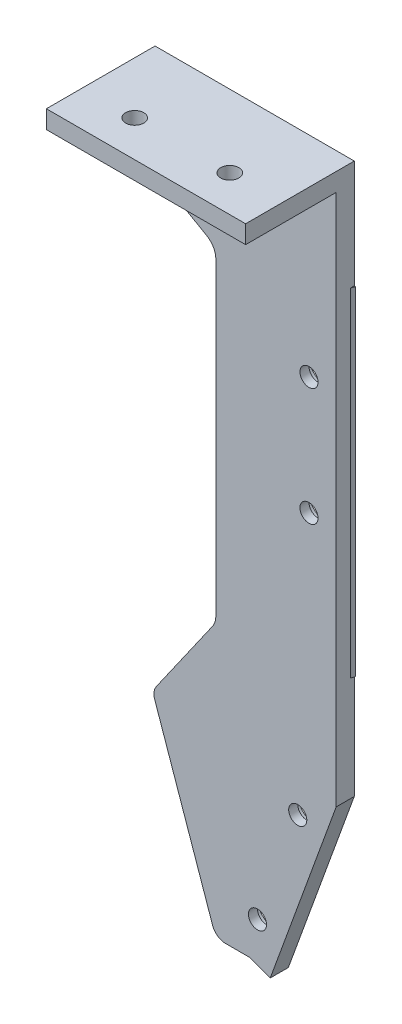
ISO-10303-21;
HEADER;
FILE_DESCRIPTION(('STEP AP214'),'2;1');
FILE_NAME('part.step','',(''),(''),'','','');
FILE_SCHEMA(('AUTOMOTIVE_DESIGN { 1 0 10303 214 1 1 1 1 }'));
ENDSEC;
DATA;
#1=APPLICATION_CONTEXT('core data for automotive mechanical design processes');
#2=APPLICATION_PROTOCOL_DEFINITION('international standard','automotive_design',2000,#1);
#3=PRODUCT_CONTEXT('',#1,'mechanical');
#4=PRODUCT('Part','Part','',(#3));
#5=PRODUCT_RELATED_PRODUCT_CATEGORY('part','',(#4));
#6=PRODUCT_DEFINITION_FORMATION('','',#4);
#7=PRODUCT_DEFINITION_CONTEXT('part definition',#1,'design');
#8=PRODUCT_DEFINITION('design','',#6,#7);
#9=PRODUCT_DEFINITION_SHAPE('','',#8);
#10=(LENGTH_UNIT() NAMED_UNIT(*) SI_UNIT(.MILLI.,.METRE.));
#11=(NAMED_UNIT(*) PLANE_ANGLE_UNIT() SI_UNIT($,.RADIAN.));
#12=(NAMED_UNIT(*) SI_UNIT($,.STERADIAN.) SOLID_ANGLE_UNIT());
#13=UNCERTAINTY_MEASURE_WITH_UNIT(LENGTH_MEASURE(1.E-05),#10,'distance_accuracy_value','');
#14=(GEOMETRIC_REPRESENTATION_CONTEXT(3) GLOBAL_UNCERTAINTY_ASSIGNED_CONTEXT((#13)) GLOBAL_UNIT_ASSIGNED_CONTEXT((#10,
#11,#12)) REPRESENTATION_CONTEXT('',''));
#15=CARTESIAN_POINT('',(0.,0.,0.));
#16=DIRECTION('',(0.,0.,1.));
#17=DIRECTION('',(1.,0.,0.));
#18=AXIS2_PLACEMENT_3D('',#15,#16,#17);
#19=CARTESIAN_POINT('',(92.2895532458189,-51.5135083268963,13.5));
#20=DIRECTION('',(0.,0.,1.));
#21=DIRECTION('',(1.,0.,0.));
#22=AXIS2_PLACEMENT_3D('',#19,#20,#21);
#23=CYLINDRICAL_SURFACE('',#22,0.999999999999998);
#24=CARTESIAN_POINT('',(92.2895532458189,-51.5135083268963,23.5));
#25=DIRECTION('',(0.,0.,1.));
#26=DIRECTION('',(1.,0.,0.));
#27=AXIS2_PLACEMENT_3D('',#24,#25,#26);
#28=CIRCLE('',#27,0.999999999999998);
#29=CARTESIAN_POINT('',(93.2895532458189,-51.5135083268963,23.5));
#30=VERTEX_POINT('',#29);
#31=EDGE_CURVE('E362',#30,#30,#28,.T.);
#32=ORIENTED_EDGE('',*,*,#31,.T.);
#33=EDGE_LOOP('',(#32));
#34=FACE_BOUND('',#33,.T.);
#35=CARTESIAN_POINT('',(92.2895532458189,-51.5135083268963,22.5));
#36=DIRECTION('',(0.,0.,-1.));
#37=DIRECTION('',(-1.,0.,0.));
#38=AXIS2_PLACEMENT_3D('',#35,#36,#37);
#39=CIRCLE('',#38,0.999999999999998);
#40=CARTESIAN_POINT('',(91.2895532458189,-51.5135083268963,22.5));
#41=VERTEX_POINT('',#40);
#42=EDGE_CURVE('E42',#41,#41,#39,.F.);
#43=ORIENTED_EDGE('',*,*,#42,.F.);
#44=EDGE_LOOP('',(#43));
#45=FACE_BOUND('',#44,.T.);
#46=ADVANCED_FACE('F38',(#34,#45),#23,.F.);
#47=CARTESIAN_POINT('',(91.0464555518717,-94.0197311334143,13.5));
#48=DIRECTION('',(0.,0.,1.));
#49=DIRECTION('',(1.,0.,0.));
#50=AXIS2_PLACEMENT_3D('',#47,#48,#49);
#51=CYLINDRICAL_SURFACE('',#50,0.999999999999998);
#52=CARTESIAN_POINT('',(91.0464555518717,-94.0197311334143,23.5));
#53=DIRECTION('',(0.,0.,1.));
#54=DIRECTION('',(1.,0.,0.));
#55=AXIS2_PLACEMENT_3D('',#52,#53,#54);
#56=CIRCLE('',#55,0.999999999999998);
#57=CARTESIAN_POINT('',(92.0464555518717,-94.0197311334143,23.5));
#58=VERTEX_POINT('',#57);
#59=EDGE_CURVE('E338',#58,#58,#56,.T.);
#60=ORIENTED_EDGE('',*,*,#59,.T.);
#61=EDGE_LOOP('',(#60));
#62=FACE_BOUND('',#61,.T.);
#63=CARTESIAN_POINT('',(91.0464555518717,-94.0197311334143,22.5));
#64=DIRECTION('',(0.,0.,-1.));
#65=DIRECTION('',(-1.,0.,0.));
#66=AXIS2_PLACEMENT_3D('',#63,#64,#65);
#67=CIRCLE('',#66,0.999999999999998);
#68=CARTESIAN_POINT('',(90.0464555518717,-94.0197311334143,22.5));
#69=VERTEX_POINT('',#68);
#70=EDGE_CURVE('E342',#69,#69,#67,.F.);
#71=ORIENTED_EDGE('',*,*,#70,.F.);
#72=EDGE_LOOP('',(#71));
#73=FACE_BOUND('',#72,.T.);
#74=ADVANCED_FACE('F462',(#62,#73),#51,.F.);
#75=CARTESIAN_POINT('',(92.2895532458189,-64.5135083268963,13.5));
#76=DIRECTION('',(0.,0.,1.));
#77=DIRECTION('',(1.,0.,0.));
#78=AXIS2_PLACEMENT_3D('',#75,#76,#77);
#79=CYLINDRICAL_SURFACE('',#78,0.999999999999998);
#80=CARTESIAN_POINT('',(92.2895532458189,-64.5135083268963,23.5));
#81=DIRECTION('',(0.,0.,1.));
#82=DIRECTION('',(1.,0.,0.));
#83=AXIS2_PLACEMENT_3D('',#80,#81,#82);
#84=CIRCLE('',#83,0.999999999999998);
#85=CARTESIAN_POINT('',(93.2895532458189,-64.5135083268963,23.5));
#86=VERTEX_POINT('',#85);
#87=EDGE_CURVE('E359',#86,#86,#84,.T.);
#88=ORIENTED_EDGE('',*,*,#87,.T.);
#89=EDGE_LOOP('',(#88));
#90=FACE_BOUND('',#89,.T.);
#91=CARTESIAN_POINT('',(92.2895532458189,-64.5135083268963,22.5));
#92=DIRECTION('',(0.,0.,-1.));
#93=DIRECTION('',(-1.,0.,0.));
#94=AXIS2_PLACEMENT_3D('',#91,#92,#93);
#95=CIRCLE('',#94,0.999999999999998);
#96=CARTESIAN_POINT('',(91.2895532458189,-64.5135083268963,22.5));
#97=VERTEX_POINT('',#96);
#98=EDGE_CURVE('E340',#97,#97,#95,.F.);
#99=ORIENTED_EDGE('',*,*,#98,.F.);
#100=EDGE_LOOP('',(#99));
#101=FACE_BOUND('',#100,.T.);
#102=ADVANCED_FACE('F468',(#90,#101),#79,.F.);
#103=CARTESIAN_POINT('',(86.6001936886376,-106.235735203631,13.5));
#104=DIRECTION('',(0.,0.,1.));
#105=DIRECTION('',(1.,0.,0.));
#106=AXIS2_PLACEMENT_3D('',#103,#104,#105);
#107=CYLINDRICAL_SURFACE('',#106,0.999999999999998);
#108=CARTESIAN_POINT('',(86.6001936886376,-106.235735203631,23.5));
#109=DIRECTION('',(0.,0.,1.));
#110=DIRECTION('',(1.,0.,0.));
#111=AXIS2_PLACEMENT_3D('',#108,#109,#110);
#112=CIRCLE('',#111,0.999999999999998);
#113=CARTESIAN_POINT('',(87.6001936886376,-106.235735203631,23.5));
#114=VERTEX_POINT('',#113);
#115=EDGE_CURVE('E363',#114,#114,#112,.T.);
#116=ORIENTED_EDGE('',*,*,#115,.T.);
#117=EDGE_LOOP('',(#116));
#118=FACE_BOUND('',#117,.T.);
#119=CARTESIAN_POINT('',(86.6001936886376,-106.235735203631,22.5));
#120=DIRECTION('',(0.,0.,-1.));
#121=DIRECTION('',(-1.,0.,0.));
#122=AXIS2_PLACEMENT_3D('',#119,#120,#121);
#123=CIRCLE('',#122,0.999999999999998);
#124=CARTESIAN_POINT('',(85.6001936886376,-106.235735203631,22.5));
#125=VERTEX_POINT('',#124);
#126=EDGE_CURVE('E335',#125,#125,#123,.F.);
#127=ORIENTED_EDGE('',*,*,#126,.F.);
#128=EDGE_LOOP('',(#127));
#129=FACE_BOUND('',#128,.T.);
#130=ADVANCED_FACE('F492',(#118,#129),#107,.F.);
#131=CARTESIAN_POINT('',(0.,0.,23.5));
#132=DIRECTION('',(0.,0.,-1.));
#133=DIRECTION('',(-1.,0.,0.));
#134=AXIS2_PLACEMENT_3D('',#131,#132,#133);
#135=PLANE('',#134);
#136=ORIENTED_EDGE('',*,*,#87,.F.);
#137=EDGE_LOOP('',(#136));
#138=FACE_BOUND('',#137,.T.);
#139=ORIENTED_EDGE('',*,*,#115,.F.);
#140=EDGE_LOOP('',(#139));
#141=FACE_BOUND('',#140,.T.);
#142=ORIENTED_EDGE('',*,*,#59,.F.);
#143=EDGE_LOOP('',(#142));
#144=FACE_BOUND('',#143,.T.);
#145=ORIENTED_EDGE('',*,*,#31,.F.);
#146=EDGE_LOOP('',(#145));
#147=FACE_BOUND('',#146,.T.);
#148=DIRECTION('',(1.,0.,0.));
#149=VECTOR('',#148,1.);
#150=CARTESIAN_POINT('',(95.2895532458189,-32.3635083268963,23.5));
#151=LINE('',#150,#149);
#152=CARTESIAN_POINT('',(73.2895532458189,-32.3635083268963,23.5));
#153=VERTEX_POINT('',#152);
#154=CARTESIAN_POINT('',(95.2895532458189,-32.3635083268963,23.5));
#155=VERTEX_POINT('',#154);
#156=EDGE_CURVE('E55',#153,#155,#151,.T.);
#157=ORIENTED_EDGE('',*,*,#156,.F.);
#158=DIRECTION('',(0.,-1.,0.));
#159=VECTOR('',#158,1.);
#160=CARTESIAN_POINT('',(73.2895532458189,0.,23.5));
#161=LINE('',#160,#159);
#162=CARTESIAN_POINT('',(73.2895532458189,-38.0445239136101,23.5));
#163=VERTEX_POINT('',#162);
#164=EDGE_CURVE('E58',#153,#163,#161,.T.);
#165=ORIENTED_EDGE('',*,*,#164,.T.);
#166=CARTESIAN_POINT('',(75.2895532458189,-38.0445239136101,23.5));
#167=DIRECTION('',(0.,0.,-1.));
#168=DIRECTION('',(-1.,0.,0.));
#169=AXIS2_PLACEMENT_3D('',#166,#167,#168);
#170=CIRCLE('',#169,2.);
#171=CARTESIAN_POINT('',(74.2895532458182,-39.7765747211803,23.5));
#172=VERTEX_POINT('',#171);
#173=EDGE_CURVE('E11',#163,#172,#170,.F.);
#174=ORIENTED_EDGE('',*,*,#173,.T.);
#175=DIRECTION('',(-0.866025403784429,0.500000000000017,0.));
#176=VECTOR('',#175,1.);
#177=CARTESIAN_POINT('',(1.34862621941938,2.3358891324538,23.5));
#178=LINE('',#177,#176);
#179=CARTESIAN_POINT('',(81.,-43.65085296109,23.5));
#180=VERTEX_POINT('',#179);
#181=EDGE_CURVE('E238',#180,#172,#178,.T.);
#182=ORIENTED_EDGE('',*,*,#181,.F.);
#183=CARTESIAN_POINT('',(80.,-45.38290376865,23.5));
#184=DIRECTION('',(0.,0.,-1.));
#185=DIRECTION('',(-1.,0.,0.));
#186=AXIS2_PLACEMENT_3D('',#183,#184,#185);
#187=CIRCLE('',#186,2.);
#188=CARTESIAN_POINT('',(82.,-45.38290376865,23.5));
#189=VERTEX_POINT('',#188);
#190=EDGE_CURVE('E235',#189,#180,#187,.F.);
#191=ORIENTED_EDGE('',*,*,#190,.F.);
#192=DIRECTION('',(0.,1.,0.));
#193=VECTOR('',#192,1.);
#194=CARTESIAN_POINT('',(82.,0.,23.5));
#195=LINE('',#194,#193);
#196=CARTESIAN_POINT('',(82.,-79.5316263413399,23.5));
#197=VERTEX_POINT('',#196);
#198=EDGE_CURVE('E232',#197,#189,#195,.T.);
#199=ORIENTED_EDGE('',*,*,#198,.F.);
#200=CARTESIAN_POINT('',(80.,-79.5316263413399,23.5));
#201=DIRECTION('',(0.,0.,-1.));
#202=DIRECTION('',(-1.,0.,0.));
#203=AXIS2_PLACEMENT_3D('',#200,#201,#202);
#204=CIRCLE('',#203,2.);
#205=CARTESIAN_POINT('',(81.6383040885789,-80.6787792140407,23.5));
#206=VERTEX_POINT('',#205);
#207=EDGE_CURVE('E229',#206,#197,#204,.F.);
#208=ORIENTED_EDGE('',*,*,#207,.F.);
#209=DIRECTION('',(0.573576436351011,0.819152044289016,0.));
#210=VECTOR('',#209,1.);
#211=CARTESIAN_POINT('',(92.6867510176329,-64.8999617547072,23.5));
#212=LINE('',#211,#210);
#213=CARTESIAN_POINT('',(75.439940364479,-89.5309600116699,23.5));
#214=VERTEX_POINT('',#213);
#215=EDGE_CURVE('E226',#214,#206,#212,.T.);
#216=ORIENTED_EDGE('',*,*,#215,.F.);
#217=CARTESIAN_POINT('',(76.668668430912,-90.3913246662,23.5));
#218=DIRECTION('',(0.,0.,-1.));
#219=DIRECTION('',(-1.,0.,0.));
#220=AXIS2_PLACEMENT_3D('',#217,#218,#219);
#221=CIRCLE('',#220,1.5);
#222=CARTESIAN_POINT('',(75.2518037731161,-90.8837620139803,23.5));
#223=VERTEX_POINT('',#222);
#224=EDGE_CURVE('E223',#223,#214,#221,.T.);
#225=ORIENTED_EDGE('',*,*,#224,.F.);
#226=DIRECTION('',(-0.328291565188003,0.944576438530208,0.));
#227=VECTOR('',#226,1.);
#228=CARTESIAN_POINT('',(38.9587796924058,13.5402898498463,23.5));
#229=LINE('',#228,#227);
#230=CARTESIAN_POINT('',(81.6498173079181,-109.29243734778,23.5));
#231=VERTEX_POINT('',#230);
#232=EDGE_CURVE('E220',#231,#223,#229,.T.);
#233=ORIENTED_EDGE('',*,*,#232,.F.);
#234=CARTESIAN_POINT('',(83.066681965713,-108.8,23.5));
#235=DIRECTION('',(0.,0.,-1.));
#236=DIRECTION('',(-1.,0.,0.));
#237=AXIS2_PLACEMENT_3D('',#234,#235,#236);
#238=CIRCLE('',#237,1.5);
#239=CARTESIAN_POINT('',(83.066681965713,-110.3,23.5));
#240=VERTEX_POINT('',#239);
#241=EDGE_CURVE('E217',#240,#231,#238,.T.);
#242=ORIENTED_EDGE('',*,*,#241,.F.);
#243=DIRECTION('',(-1.,0.,0.));
#244=VECTOR('',#243,1.);
#245=CARTESIAN_POINT('',(-1.77186336060973E-12,-110.299999999999,23.5));
#246=LINE('',#245,#244);
#247=CARTESIAN_POINT('',(85.720595314676,-110.3,23.5));
#248=VERTEX_POINT('',#247);
#249=EDGE_CURVE('E214',#248,#240,#246,.T.);
#250=ORIENTED_EDGE('',*,*,#249,.F.);
#251=DIRECTION('',(-0.939692620785897,0.342020143325699,0.));
#252=VECTOR('',#251,1.);
#253=CARTESIAN_POINT('',(-25.4223318677038,-69.8472827563908,23.5));
#254=LINE('',#253,#252);
#255=CARTESIAN_POINT('',(88.0101485604946,-111.133329231243,23.5));
#256=VERTEX_POINT('',#255);
#257=EDGE_CURVE('E211',#256,#248,#254,.T.);
#258=ORIENTED_EDGE('',*,*,#257,.F.);
#259=DIRECTION('',(-0.342020143325699,-0.939692620785897,0.));
#260=VECTOR('',#259,1.);
#261=CARTESIAN_POINT('',(113.432480428198,-41.2860464748519,23.5));
#262=LINE('',#261,#260);
#263=CARTESIAN_POINT('',(95.2895532458189,-91.1333292312439,23.5));
#264=VERTEX_POINT('',#263);
#265=EDGE_CURVE('E207',#264,#256,#262,.T.);
#266=ORIENTED_EDGE('',*,*,#265,.F.);
#267=DIRECTION('',(0.,1.,0.));
#268=VECTOR('',#267,1.);
#269=CARTESIAN_POINT('',(95.2895532458189,0.,23.5));
#270=LINE('',#269,#268);
#271=EDGE_CURVE('E205',#264,#155,#270,.T.);
#272=ORIENTED_EDGE('',*,*,#271,.T.);
#273=EDGE_LOOP('',(#157,#165,#174,#182,#191,#199,#208,#216,#225,#233,#242,#250,#258,#266,#272));
#274=FACE_BOUND('',#273,.T.);
#275=ADVANCED_FACE('F403',(#138,#141,#144,#147,#274),#135,.F.);
#276=CARTESIAN_POINT('',(93.5,-42.3,21.));
#277=DIRECTION('',(0.,-1.,0.));
#278=DIRECTION('',(-1.,0.,0.));
#279=AXIS2_PLACEMENT_3D('',#276,#277,#278);
#280=CYLINDRICAL_SURFACE('',#279,2.);
#281=CARTESIAN_POINT('',(93.5,-42.3,21.));
#282=DIRECTION('',(0.,-1.,0.));
#283=DIRECTION('',(1.,0.,0.));
#284=AXIS2_PLACEMENT_3D('',#281,#282,#283);
#285=CIRCLE('',#284,2.);
#286=CARTESIAN_POINT('',(95.4364916731037,-42.3,21.5));
#287=VERTEX_POINT('',#286);
#288=CARTESIAN_POINT('',(95.2895532458189,-42.3,21.8930280960748));
#289=VERTEX_POINT('',#288);
#290=EDGE_CURVE('E323',#287,#289,#285,.T.);
#291=ORIENTED_EDGE('',*,*,#290,.T.);
#292=DIRECTION('',(0.,-1.,0.));
#293=VECTOR('',#292,1.);
#294=CARTESIAN_POINT('',(95.2895532458189,-42.3,21.8930280960748));
#295=LINE('',#294,#293);
#296=CARTESIAN_POINT('',(95.2895532458189,-79.5997924618132,21.8930280960748));
#297=VERTEX_POINT('',#296);
#298=EDGE_CURVE('E253',#289,#297,#295,.T.);
#299=ORIENTED_EDGE('',*,*,#298,.T.);
#300=CARTESIAN_POINT('',(93.5,-79.59979246179,21.));
#301=DIRECTION('',(0.,-1.,0.));
#302=DIRECTION('',(1.,0.,0.));
#303=AXIS2_PLACEMENT_3D('',#300,#301,#302);
#304=CIRCLE('',#303,2.);
#305=CARTESIAN_POINT('',(95.4364916731037,-79.5997924618132,21.5));
#306=VERTEX_POINT('',#305);
#307=EDGE_CURVE('E274',#306,#297,#304,.T.);
#308=ORIENTED_EDGE('',*,*,#307,.F.);
#309=DIRECTION('',(0.,-1.,0.));
#310=VECTOR('',#309,1.);
#311=CARTESIAN_POINT('',(95.4364916731037,-42.3,21.5));
#312=LINE('',#311,#310);
#313=EDGE_CURVE('E265',#287,#306,#312,.T.);
#314=ORIENTED_EDGE('',*,*,#313,.F.);
#315=EDGE_LOOP('',(#291,#299,#308,#314));
#316=FACE_BOUND('',#315,.T.);
#317=ADVANCED_FACE('F448',(#316),#280,.T.);
#318=CARTESIAN_POINT('',(94.38388347648,-79.59979246179,21.88388347648));
#319=DIRECTION('',(0.,1.,0.));
#320=DIRECTION('',(0.,0.,-1.));
#321=AXIS2_PLACEMENT_3D('',#318,#319,#320);
#322=PLANE('',#321);
#323=DIRECTION('',(0.,0.,1.));
#324=VECTOR('',#323,1.);
#325=CARTESIAN_POINT('',(95.2895532458189,-79.59979246179,21.88388347648));
#326=LINE('',#325,#324);
#327=CARTESIAN_POINT('',(95.2895532458189,-79.5997924618016,21.5));
#328=VERTEX_POINT('',#327);
#329=EDGE_CURVE('E256',#328,#297,#326,.T.);
#330=ORIENTED_EDGE('',*,*,#329,.F.);
#331=DIRECTION('',(1.,0.,0.));
#332=VECTOR('',#331,1.);
#333=CARTESIAN_POINT('',(94.38388347648,-79.59979246179,21.5));
#334=LINE('',#333,#332);
#335=EDGE_CURVE('E268',#328,#306,#334,.T.);
#336=ORIENTED_EDGE('',*,*,#335,.T.);
#337=ORIENTED_EDGE('',*,*,#307,.T.);
#338=EDGE_LOOP('',(#330,#336,#337));
#339=FACE_BOUND('',#338,.T.);
#340=ADVANCED_FACE('F442',(#339),#322,.F.);
#341=CARTESIAN_POINT('',(94.75,-42.3,18.));
#342=DIRECTION('',(0.,1.,0.));
#343=DIRECTION('',(0.,0.,-1.));
#344=AXIS2_PLACEMENT_3D('',#341,#342,#343);
#345=PLANE('',#344);
#346=DIRECTION('',(1.,0.,0.));
#347=VECTOR('',#346,1.);
#348=CARTESIAN_POINT('',(94.75,-42.3,21.5));
#349=LINE('',#348,#347);
#350=CARTESIAN_POINT('',(95.2895532458189,-42.3,21.5));
#351=VERTEX_POINT('',#350);
#352=EDGE_CURVE('E263',#351,#287,#349,.T.);
#353=ORIENTED_EDGE('',*,*,#352,.F.);
#354=DIRECTION('',(0.,0.,1.));
#355=VECTOR('',#354,1.);
#356=CARTESIAN_POINT('',(95.2895532458189,-42.3,18.));
#357=LINE('',#356,#355);
#358=EDGE_CURVE('E246',#351,#289,#357,.T.);
#359=ORIENTED_EDGE('',*,*,#358,.T.);
#360=ORIENTED_EDGE('',*,*,#290,.F.);
#361=EDGE_LOOP('',(#353,#359,#360));
#362=FACE_BOUND('',#361,.T.);
#363=ADVANCED_FACE('F450',(#362),#345,.T.);
#364=CARTESIAN_POINT('',(70.,-110.3,21.5));
#365=DIRECTION('',(0.,0.,1.));
#366=DIRECTION('',(0.,-1.,0.));
#367=AXIS2_PLACEMENT_3D('',#364,#365,#366);
#368=PLANE('',#367);
#369=CARTESIAN_POINT('',(91.0464555518717,-94.0197311334143,21.5));
#370=DIRECTION('',(0.,0.,-1.));
#371=DIRECTION('',(-1.,0.,0.));
#372=AXIS2_PLACEMENT_3D('',#369,#370,#371);
#373=CIRCLE('',#372,2.);
#374=CARTESIAN_POINT('',(89.0464555518717,-94.0197311334143,21.5));
#375=VERTEX_POINT('',#374);
#376=EDGE_CURVE('E801',#375,#375,#373,.T.);
#377=ORIENTED_EDGE('',*,*,#376,.F.);
#378=EDGE_LOOP('',(#377));
#379=FACE_BOUND('',#378,.T.);
#380=CARTESIAN_POINT('',(92.2895532458189,-64.5135083268963,21.5));
#381=DIRECTION('',(0.,0.,-1.));
#382=DIRECTION('',(-1.,0.,0.));
#383=AXIS2_PLACEMENT_3D('',#380,#381,#382);
#384=CIRCLE('',#383,2.);
#385=CARTESIAN_POINT('',(90.2895532458189,-64.5135083268963,21.5));
#386=VERTEX_POINT('',#385);
#387=EDGE_CURVE('E793',#386,#386,#384,.T.);
#388=ORIENTED_EDGE('',*,*,#387,.F.);
#389=EDGE_LOOP('',(#388));
#390=FACE_BOUND('',#389,.T.);
#391=CARTESIAN_POINT('',(92.2895532458189,-51.5135083268963,21.5));
#392=DIRECTION('',(0.,0.,-1.));
#393=DIRECTION('',(-1.,0.,0.));
#394=AXIS2_PLACEMENT_3D('',#391,#392,#393);
#395=CIRCLE('',#394,2.);
#396=CARTESIAN_POINT('',(90.2895532458189,-51.5135083268963,21.5));
#397=VERTEX_POINT('',#396);
#398=EDGE_CURVE('E791',#397,#397,#395,.T.);
#399=ORIENTED_EDGE('',*,*,#398,.F.);
#400=EDGE_LOOP('',(#399));
#401=FACE_BOUND('',#400,.T.);
#402=CARTESIAN_POINT('',(86.6001936886376,-106.235735203631,21.5));
#403=DIRECTION('',(0.,0.,-1.));
#404=DIRECTION('',(-1.,0.,0.));
#405=AXIS2_PLACEMENT_3D('',#402,#403,#404);
#406=CIRCLE('',#405,2.);
#407=CARTESIAN_POINT('',(84.6001936886376,-106.235735203631,21.5));
#408=VERTEX_POINT('',#407);
#409=EDGE_CURVE('E348',#408,#408,#406,.T.);
#410=ORIENTED_EDGE('',*,*,#409,.F.);
#411=EDGE_LOOP('',(#410));
#412=FACE_BOUND('',#411,.T.);
#413=DIRECTION('',(-0.866025403784429,0.500000000000017,0.));
#414=VECTOR('',#413,1.);
#415=CARTESIAN_POINT('',(81.,-43.65085296109,21.5));
#416=LINE('',#415,#414);
#417=CARTESIAN_POINT('',(81.,-43.65085296109,21.5));
#418=VERTEX_POINT('',#417);
#419=CARTESIAN_POINT('',(74.2895532458181,-39.7765747211803,21.5));
#420=VERTEX_POINT('',#419);
#421=EDGE_CURVE('E299',#418,#420,#416,.T.);
#422=ORIENTED_EDGE('',*,*,#421,.T.);
#423=CARTESIAN_POINT('',(75.2895532458189,-38.0445239136101,21.5));
#424=DIRECTION('',(0.,0.,1.));
#425=DIRECTION('',(1.,0.,0.));
#426=AXIS2_PLACEMENT_3D('',#423,#424,#425);
#427=CIRCLE('',#426,2.);
#428=CARTESIAN_POINT('',(73.2895532458189,-38.0445239136101,21.5));
#429=VERTEX_POINT('',#428);
#430=EDGE_CURVE('E332',#420,#429,#427,.F.);
#431=ORIENTED_EDGE('',*,*,#430,.T.);
#432=DIRECTION('',(0.,-1.,0.));
#433=VECTOR('',#432,1.);
#434=CARTESIAN_POINT('',(73.2895532458189,0.,21.5));
#435=LINE('',#434,#433);
#436=CARTESIAN_POINT('',(73.2895532458189,-30.3635083268963,21.5));
#437=VERTEX_POINT('',#436);
#438=EDGE_CURVE('E196',#437,#429,#435,.T.);
#439=ORIENTED_EDGE('',*,*,#438,.F.);
#440=DIRECTION('',(-1.,0.,0.));
#441=VECTOR('',#440,1.);
#442=CARTESIAN_POINT('',(70.,-30.3635083268963,21.5));
#443=LINE('',#442,#441);
#444=CARTESIAN_POINT('',(95.2895532458189,-30.3635083268963,21.5));
#445=VERTEX_POINT('',#444);
#446=EDGE_CURVE('E261',#437,#445,#443,.F.);
#447=ORIENTED_EDGE('',*,*,#446,.T.);
#448=DIRECTION('',(0.,1.,0.));
#449=VECTOR('',#448,1.);
#450=CARTESIAN_POINT('',(95.2895532458189,0.,21.5));
#451=LINE('',#450,#449);
#452=EDGE_CURVE('E204',#351,#445,#451,.T.);
#453=ORIENTED_EDGE('',*,*,#452,.F.);
#454=ORIENTED_EDGE('',*,*,#352,.T.);
#455=ORIENTED_EDGE('',*,*,#313,.T.);
#456=ORIENTED_EDGE('',*,*,#335,.F.);
#457=CARTESIAN_POINT('',(95.2895532458189,-91.1333292312439,21.5));
#458=VERTEX_POINT('',#457);
#459=EDGE_CURVE('E208',#458,#328,#451,.T.);
#460=ORIENTED_EDGE('',*,*,#459,.F.);
#461=DIRECTION('',(-0.342020143325699,-0.939692620785897,0.));
#462=VECTOR('',#461,1.);
#463=CARTESIAN_POINT('',(95.2895532458189,-91.1333292312439,21.5));
#464=LINE('',#463,#462);
#465=CARTESIAN_POINT('',(88.0101485604946,-111.133329231243,21.5));
#466=VERTEX_POINT('',#465);
#467=EDGE_CURVE('E258',#458,#466,#464,.T.);
#468=ORIENTED_EDGE('',*,*,#467,.T.);
#469=DIRECTION('',(-0.939692620785897,0.342020143325699,0.));
#470=VECTOR('',#469,1.);
#471=CARTESIAN_POINT('',(86.190441625069,-110.47101007166,21.5));
#472=LINE('',#471,#470);
#473=CARTESIAN_POINT('',(85.720595314676,-110.3,21.5));
#474=VERTEX_POINT('',#473);
#475=EDGE_CURVE('E271',#466,#474,#472,.T.);
#476=ORIENTED_EDGE('',*,*,#475,.T.);
#477=DIRECTION('',(1.,0.,0.));
#478=VECTOR('',#477,1.);
#479=CARTESIAN_POINT('',(83.066681965713,-110.3,21.5));
#480=LINE('',#479,#478);
#481=CARTESIAN_POINT('',(83.066681965713,-110.3,21.5));
#482=VERTEX_POINT('',#481);
#483=EDGE_CURVE('E276',#482,#474,#480,.T.);
#484=ORIENTED_EDGE('',*,*,#483,.F.);
#485=CARTESIAN_POINT('',(83.066681965713,-108.8,21.5));
#486=DIRECTION('',(0.,0.,-1.));
#487=DIRECTION('',(0.,-1.,0.));
#488=AXIS2_PLACEMENT_3D('',#485,#486,#487);
#489=CIRCLE('',#488,1.5);
#490=CARTESIAN_POINT('',(81.6498173079181,-109.29243734778,21.5));
#491=VERTEX_POINT('',#490);
#492=EDGE_CURVE('E275',#482,#491,#489,.T.);
#493=ORIENTED_EDGE('',*,*,#492,.T.);
#494=DIRECTION('',(-0.328291565188003,0.944576438530208,0.));
#495=VECTOR('',#494,1.);
#496=CARTESIAN_POINT('',(81.6498173079181,-109.29243734778,21.5));
#497=LINE('',#496,#495);
#498=CARTESIAN_POINT('',(75.251803773117,-90.88376201398,21.5));
#499=VERTEX_POINT('',#498);
#500=EDGE_CURVE('E281',#491,#499,#497,.T.);
#501=ORIENTED_EDGE('',*,*,#500,.T.);
#502=CARTESIAN_POINT('',(76.668668430912,-90.3913246662,21.5));
#503=DIRECTION('',(0.,0.,-1.));
#504=DIRECTION('',(-0.944576438530206,-0.328291565188007,0.));
#505=AXIS2_PLACEMENT_3D('',#502,#503,#504);
#506=CIRCLE('',#505,1.5);
#507=CARTESIAN_POINT('',(75.439940364479,-89.5309600116699,21.5));
#508=VERTEX_POINT('',#507);
#509=EDGE_CURVE('E284',#499,#508,#506,.T.);
#510=ORIENTED_EDGE('',*,*,#509,.T.);
#511=DIRECTION('',(0.573576436351011,0.819152044289016,0.));
#512=VECTOR('',#511,1.);
#513=CARTESIAN_POINT('',(75.439940364479,-89.5309600116699,21.5));
#514=LINE('',#513,#512);
#515=CARTESIAN_POINT('',(81.638304088578,-80.67877921404,21.5));
#516=VERTEX_POINT('',#515);
#517=EDGE_CURVE('E287',#508,#516,#514,.T.);
#518=ORIENTED_EDGE('',*,*,#517,.T.);
#519=CARTESIAN_POINT('',(80.,-79.5316263413399,21.5));
#520=DIRECTION('',(0.,0.,1.));
#521=DIRECTION('',(0.81915204428897,-0.573576436351077,0.));
#522=AXIS2_PLACEMENT_3D('',#519,#520,#521);
#523=CIRCLE('',#522,2.);
#524=CARTESIAN_POINT('',(82.,-79.5316263413399,21.5));
#525=VERTEX_POINT('',#524);
#526=EDGE_CURVE('E290',#516,#525,#523,.T.);
#527=ORIENTED_EDGE('',*,*,#526,.T.);
#528=DIRECTION('',(0.,1.,0.));
#529=VECTOR('',#528,1.);
#530=CARTESIAN_POINT('',(82.,-79.5316263413399,21.5));
#531=LINE('',#530,#529);
#532=CARTESIAN_POINT('',(82.,-45.38290376865,21.5));
#533=VERTEX_POINT('',#532);
#534=EDGE_CURVE('E293',#525,#533,#531,.T.);
#535=ORIENTED_EDGE('',*,*,#534,.T.);
#536=CARTESIAN_POINT('',(80.,-45.38290376865,21.5));
#537=DIRECTION('',(0.,0.,1.));
#538=DIRECTION('',(1.,0.,0.));
#539=AXIS2_PLACEMENT_3D('',#536,#537,#538);
#540=CIRCLE('',#539,2.);
#541=EDGE_CURVE('E296',#533,#418,#540,.T.);
#542=ORIENTED_EDGE('',*,*,#541,.T.);
#543=EDGE_LOOP('',(#422,#431,#439,#447,#453,#454,#455,#456,#460,#468,#476,#484,#493,#501,#510,
#518,#527,#535,#542));
#544=FACE_BOUND('',#543,.T.);
#545=ADVANCED_FACE('F394',(#379,#390,#401,#412,#544),#368,.F.);
#546=CARTESIAN_POINT('',(76.,-40.76410161514,22.25));
#547=DIRECTION('',(0.500000000000017,0.866025403784429,0.));
#548=DIRECTION('',(0.866025403784429,-0.500000000000017,0.));
#549=AXIS2_PLACEMENT_3D('',#546,#547,#548);
#550=PLANE('',#549);
#551=ORIENTED_EDGE('',*,*,#181,.T.);
#552=DIRECTION('',(0.,0.,-1.));
#553=VECTOR('',#552,1.);
#554=CARTESIAN_POINT('',(74.2895532458189,-39.776574721179,22.25));
#555=LINE('',#554,#553);
#556=EDGE_CURVE('E329',#172,#420,#555,.T.);
#557=ORIENTED_EDGE('',*,*,#556,.T.);
#558=ORIENTED_EDGE('',*,*,#421,.F.);
#559=DIRECTION('',(0.,0.,-1.));
#560=VECTOR('',#559,1.);
#561=CARTESIAN_POINT('',(81.,-43.65085296109,23.));
#562=LINE('',#561,#560);
#563=EDGE_CURVE('E302',#180,#418,#562,.T.);
#564=ORIENTED_EDGE('',*,*,#563,.F.);
#565=EDGE_LOOP('',(#551,#557,#558,#564));
#566=FACE_BOUND('',#565,.T.);
#567=ADVANCED_FACE('F400',(#566),#550,.F.);
#568=CARTESIAN_POINT('',(80.,-45.38290376865,69.9296));
#569=DIRECTION('',(0.,0.,-1.));
#570=DIRECTION('',(-0.500000000000015,-0.86602540378443,0.));
#571=AXIS2_PLACEMENT_3D('',#568,#569,#570);
#572=CYLINDRICAL_SURFACE('',#571,2.);
#573=ORIENTED_EDGE('',*,*,#541,.F.);
#574=DIRECTION('',(0.,0.,-1.));
#575=VECTOR('',#574,1.);
#576=CARTESIAN_POINT('',(82.,-45.38290376865,23.));
#577=LINE('',#576,#575);
#578=EDGE_CURVE('E305',#189,#533,#577,.T.);
#579=ORIENTED_EDGE('',*,*,#578,.F.);
#580=ORIENTED_EDGE('',*,*,#190,.T.);
#581=ORIENTED_EDGE('',*,*,#563,.T.);
#582=EDGE_LOOP('',(#573,#579,#580,#581));
#583=FACE_BOUND('',#582,.T.);
#584=ADVANCED_FACE('F406',(#583),#572,.F.);
#585=CARTESIAN_POINT('',(82.,-62.19521357469,22.25));
#586=DIRECTION('',(1.,0.,0.));
#587=DIRECTION('',(0.,-1.,0.));
#588=AXIS2_PLACEMENT_3D('',#585,#586,#587);
#589=PLANE('',#588);
#590=DIRECTION('',(0.,0.,-1.));
#591=VECTOR('',#590,1.);
#592=CARTESIAN_POINT('',(82.,-79.5316263413399,23.));
#593=LINE('',#592,#591);
#594=EDGE_CURVE('E308',#197,#525,#593,.T.);
#595=ORIENTED_EDGE('',*,*,#594,.F.);
#596=ORIENTED_EDGE('',*,*,#198,.T.);
#597=ORIENTED_EDGE('',*,*,#578,.T.);
#598=ORIENTED_EDGE('',*,*,#534,.F.);
#599=EDGE_LOOP('',(#595,#596,#597,#598));
#600=FACE_BOUND('',#599,.T.);
#601=ADVANCED_FACE('F408',(#600),#589,.F.);
#602=CARTESIAN_POINT('',(80.,-79.5316263413399,69.9296));
#603=DIRECTION('',(0.,0.,-1.));
#604=DIRECTION('',(-1.,0.,0.));
#605=AXIS2_PLACEMENT_3D('',#602,#603,#604);
#606=CYLINDRICAL_SURFACE('',#605,2.);
#607=ORIENTED_EDGE('',*,*,#526,.F.);
#608=DIRECTION('',(0.,0.,-1.));
#609=VECTOR('',#608,1.);
#610=CARTESIAN_POINT('',(81.638304088578,-80.67877921404,23.));
#611=LINE('',#610,#609);
#612=EDGE_CURVE('E312',#206,#516,#611,.T.);
#613=ORIENTED_EDGE('',*,*,#612,.F.);
#614=ORIENTED_EDGE('',*,*,#207,.T.);
#615=ORIENTED_EDGE('',*,*,#594,.T.);
#616=EDGE_LOOP('',(#607,#613,#614,#615));
#617=FACE_BOUND('',#616,.T.);
#618=ADVANCED_FACE('F412',(#617),#606,.F.);
#619=CARTESIAN_POINT('',(76.,-88.7311119595499,22.25));
#620=DIRECTION('',(0.819152044289016,-0.573576436351011,0.));
#621=DIRECTION('',(-0.573576436351011,-0.819152044289016,0.));
#622=AXIS2_PLACEMENT_3D('',#619,#620,#621);
#623=PLANE('',#622);
#624=ORIENTED_EDGE('',*,*,#517,.F.);
#625=DIRECTION('',(0.,0.,1.));
#626=VECTOR('',#625,1.);
#627=CARTESIAN_POINT('',(75.439940364479,-89.5309600116699,21.5));
#628=LINE('',#627,#626);
#629=EDGE_CURVE('E311',#508,#214,#628,.T.);
#630=ORIENTED_EDGE('',*,*,#629,.T.);
#631=ORIENTED_EDGE('',*,*,#215,.T.);
#632=ORIENTED_EDGE('',*,*,#612,.T.);
#633=EDGE_LOOP('',(#624,#630,#631,#632));
#634=FACE_BOUND('',#633,.T.);
#635=ADVANCED_FACE('F414',(#634),#623,.F.);
#636=CARTESIAN_POINT('',(76.668668430912,-90.3913246662,-59.9296));
#637=DIRECTION('',(0.,0.,1.));
#638=DIRECTION('',(0.819152044289016,-0.573576436351012,0.));
#639=AXIS2_PLACEMENT_3D('',#636,#637,#638);
#640=CYLINDRICAL_SURFACE('',#639,1.5);
#641=ORIENTED_EDGE('',*,*,#629,.F.);
#642=ORIENTED_EDGE('',*,*,#509,.F.);
#643=DIRECTION('',(0.,0.,1.));
#644=VECTOR('',#643,1.);
#645=CARTESIAN_POINT('',(75.251803773117,-90.88376201398,21.5));
#646=LINE('',#645,#644);
#647=EDGE_CURVE('E315',#499,#223,#646,.T.);
#648=ORIENTED_EDGE('',*,*,#647,.T.);
#649=ORIENTED_EDGE('',*,*,#224,.T.);
#650=EDGE_LOOP('',(#641,#642,#648,#649));
#651=FACE_BOUND('',#650,.T.);
#652=ADVANCED_FACE('F419',(#651),#640,.T.);
#653=CARTESIAN_POINT('',(78.5,-100.22962998314,22.25));
#654=DIRECTION('',(0.944576438530208,0.328291565188003,0.));
#655=DIRECTION('',(0.328291565188003,-0.944576438530208,0.));
#656=AXIS2_PLACEMENT_3D('',#653,#654,#655);
#657=PLANE('',#656);
#658=ORIENTED_EDGE('',*,*,#500,.F.);
#659=DIRECTION('',(0.,0.,1.));
#660=VECTOR('',#659,1.);
#661=CARTESIAN_POINT('',(81.6498173079181,-109.29243734778,21.5));
#662=LINE('',#661,#660);
#663=EDGE_CURVE('E318',#491,#231,#662,.T.);
#664=ORIENTED_EDGE('',*,*,#663,.T.);
#665=ORIENTED_EDGE('',*,*,#232,.T.);
#666=ORIENTED_EDGE('',*,*,#647,.F.);
#667=EDGE_LOOP('',(#658,#664,#665,#666));
#668=FACE_BOUND('',#667,.T.);
#669=ADVANCED_FACE('F422',(#668),#657,.F.);
#670=CARTESIAN_POINT('',(83.066681965713,-108.8,-59.9296));
#671=DIRECTION('',(0.,0.,1.));
#672=DIRECTION('',(0.944576438530206,0.328291565188007,0.));
#673=AXIS2_PLACEMENT_3D('',#670,#671,#672);
#674=CYLINDRICAL_SURFACE('',#673,1.5);
#675=ORIENTED_EDGE('',*,*,#663,.F.);
#676=ORIENTED_EDGE('',*,*,#492,.F.);
#677=DIRECTION('',(0.,0.,1.));
#678=VECTOR('',#677,1.);
#679=CARTESIAN_POINT('',(83.066681965713,-110.3,21.5));
#680=LINE('',#679,#678);
#681=EDGE_CURVE('E278',#482,#240,#680,.T.);
#682=ORIENTED_EDGE('',*,*,#681,.T.);
#683=ORIENTED_EDGE('',*,*,#241,.T.);
#684=EDGE_LOOP('',(#675,#676,#682,#683));
#685=FACE_BOUND('',#684,.T.);
#686=ADVANCED_FACE('F427',(#685),#674,.T.);
#687=CARTESIAN_POINT('',(81.5,-110.3,22.25));
#688=DIRECTION('',(0.,-1.,0.));
#689=DIRECTION('',(-1.,0.,0.));
#690=AXIS2_PLACEMENT_3D('',#687,#688,#689);
#691=PLANE('',#690);
#692=ORIENTED_EDGE('',*,*,#483,.T.);
#693=DIRECTION('',(0.,0.,-1.));
#694=VECTOR('',#693,1.);
#695=CARTESIAN_POINT('',(85.720595314676,-110.3,23.));
#696=LINE('',#695,#694);
#697=EDGE_CURVE('E270',#248,#474,#696,.T.);
#698=ORIENTED_EDGE('',*,*,#697,.F.);
#699=ORIENTED_EDGE('',*,*,#249,.T.);
#700=ORIENTED_EDGE('',*,*,#681,.F.);
#701=EDGE_LOOP('',(#692,#698,#699,#700));
#702=FACE_BOUND('',#701,.T.);
#703=ADVANCED_FACE('F431',(#702),#691,.T.);
#704=CARTESIAN_POINT('',(86.190441625069,-110.47101007166,22.25));
#705=DIRECTION('',(-0.342020143325699,-0.939692620785897,0.));
#706=DIRECTION('',(-0.939692620785897,0.342020143325699,0.));
#707=AXIS2_PLACEMENT_3D('',#704,#705,#706);
#708=PLANE('',#707);
#709=ORIENTED_EDGE('',*,*,#475,.F.);
#710=DIRECTION('',(0.,0.,-1.));
#711=VECTOR('',#710,1.);
#712=CARTESIAN_POINT('',(88.0101485604946,-111.133329231243,23.5));
#713=LINE('',#712,#711);
#714=EDGE_CURVE('E247',#256,#466,#713,.T.);
#715=ORIENTED_EDGE('',*,*,#714,.F.);
#716=ORIENTED_EDGE('',*,*,#257,.T.);
#717=ORIENTED_EDGE('',*,*,#697,.T.);
#718=EDGE_LOOP('',(#709,#715,#716,#717));
#719=FACE_BOUND('',#718,.T.);
#720=ADVANCED_FACE('F435',(#719),#708,.T.);
#721=CARTESIAN_POINT('',(95.2895532458189,0.,23.5));
#722=DIRECTION('',(-1.,0.,0.));
#723=DIRECTION('',(0.,0.,1.));
#724=AXIS2_PLACEMENT_3D('',#721,#722,#723);
#725=PLANE('',#724);
#726=ORIENTED_EDGE('',*,*,#459,.T.);
#727=ORIENTED_EDGE('',*,*,#329,.T.);
#728=ORIENTED_EDGE('',*,*,#298,.F.);
#729=ORIENTED_EDGE('',*,*,#358,.F.);
#730=ORIENTED_EDGE('',*,*,#452,.T.);
#731=DIRECTION('',(0.,0.,-1.));
#732=VECTOR('',#731,1.);
#733=CARTESIAN_POINT('',(95.2895532458189,-30.3635083268963,23.5));
#734=LINE('',#733,#732);
#735=CARTESIAN_POINT('',(95.2895532458189,-30.3635083268963,33.5));
#736=VERTEX_POINT('',#735);
#737=EDGE_CURVE('E243',#736,#445,#734,.T.);
#738=ORIENTED_EDGE('',*,*,#737,.F.);
#739=DIRECTION('',(0.,1.,0.));
#740=VECTOR('',#739,1.);
#741=CARTESIAN_POINT('',(95.2895532458189,-30.3635083268963,33.5));
#742=LINE('',#741,#740);
#743=CARTESIAN_POINT('',(95.2895532458189,-32.3635083268963,33.5));
#744=VERTEX_POINT('',#743);
#745=EDGE_CURVE('E184',#744,#736,#742,.T.);
#746=ORIENTED_EDGE('',*,*,#745,.F.);
#747=DIRECTION('',(0.,0.,-1.));
#748=VECTOR('',#747,1.);
#749=CARTESIAN_POINT('',(95.2895532458189,-32.3635083268963,33.5));
#750=LINE('',#749,#748);
#751=EDGE_CURVE('E180',#744,#155,#750,.T.);
#752=ORIENTED_EDGE('',*,*,#751,.T.);
#753=ORIENTED_EDGE('',*,*,#271,.F.);
#754=DIRECTION('',(0.,0.,-1.));
#755=VECTOR('',#754,1.);
#756=CARTESIAN_POINT('',(95.2895532458189,-91.1333292312439,23.5));
#757=LINE('',#756,#755);
#758=EDGE_CURVE('E241',#264,#458,#757,.T.);
#759=ORIENTED_EDGE('',*,*,#758,.T.);
#760=EDGE_LOOP('',(#726,#727,#728,#729,#730,#738,#746,#752,#753,#759));
#761=FACE_BOUND('',#760,.T.);
#762=ADVANCED_FACE('F385',(#761),#725,.F.);
#763=CARTESIAN_POINT('',(0.,-30.3635083268963,23.5));
#764=DIRECTION('',(0.,1.,0.));
#765=DIRECTION('',(0.,0.,1.));
#766=AXIS2_PLACEMENT_3D('',#763,#764,#765);
#767=PLANE('',#766);
#768=CARTESIAN_POINT('',(79.0395532458189,-30.3635083268963,29.5));
#769=DIRECTION('',(0.,1.,0.));
#770=DIRECTION('',(0.,0.,1.));
#771=AXIS2_PLACEMENT_3D('',#768,#769,#770);
#772=CIRCLE('',#771,0.999999999999998);
#773=CARTESIAN_POINT('',(79.0395532458189,-30.3635083268963,30.5));
#774=VERTEX_POINT('',#773);
#775=EDGE_CURVE('E373',#774,#774,#772,.T.);
#776=ORIENTED_EDGE('',*,*,#775,.F.);
#777=EDGE_LOOP('',(#776));
#778=FACE_BOUND('',#777,.T.);
#779=CARTESIAN_POINT('',(89.5395532458189,-30.3635083268963,29.5));
#780=DIRECTION('',(0.,1.,0.));
#781=DIRECTION('',(0.,0.,1.));
#782=AXIS2_PLACEMENT_3D('',#779,#780,#781);
#783=CIRCLE('',#782,0.999999999999998);
#784=CARTESIAN_POINT('',(89.5395532458189,-30.3635083268963,30.5));
#785=VERTEX_POINT('',#784);
#786=EDGE_CURVE('E379',#785,#785,#783,.T.);
#787=ORIENTED_EDGE('',*,*,#786,.F.);
#788=EDGE_LOOP('',(#787));
#789=FACE_BOUND('',#788,.T.);
#790=DIRECTION('',(0.,0.,-1.));
#791=VECTOR('',#790,1.);
#792=CARTESIAN_POINT('',(73.2895532458189,-30.3635083268963,31.5));
#793=LINE('',#792,#791);
#794=CARTESIAN_POINT('',(73.2895532458189,-30.3635083268963,33.5));
#795=VERTEX_POINT('',#794);
#796=EDGE_CURVE('E198',#795,#437,#793,.T.);
#797=ORIENTED_EDGE('',*,*,#796,.F.);
#798=DIRECTION('',(-1.,0.,0.));
#799=VECTOR('',#798,1.);
#800=CARTESIAN_POINT('',(73.2895532458189,-30.3635083268963,33.5));
#801=LINE('',#800,#799);
#802=EDGE_CURVE('E191',#736,#795,#801,.T.);
#803=ORIENTED_EDGE('',*,*,#802,.F.);
#804=ORIENTED_EDGE('',*,*,#737,.T.);
#805=ORIENTED_EDGE('',*,*,#446,.F.);
#806=EDGE_LOOP('',(#797,#803,#804,#805));
#807=FACE_BOUND('',#806,.T.);
#808=ADVANCED_FACE('F389',(#778,#789,#807),#767,.T.);
#809=CARTESIAN_POINT('',(113.432480428198,-41.2860464748519,23.5));
#810=DIRECTION('',(0.939692620785897,-0.342020143325699,0.));
#811=DIRECTION('',(0.342020143325699,0.939692620785897,0.));
#812=AXIS2_PLACEMENT_3D('',#809,#810,#811);
#813=PLANE('',#812);
#814=ORIENTED_EDGE('',*,*,#467,.F.);
#815=ORIENTED_EDGE('',*,*,#758,.F.);
#816=ORIENTED_EDGE('',*,*,#265,.T.);
#817=ORIENTED_EDGE('',*,*,#714,.T.);
#818=EDGE_LOOP('',(#814,#815,#816,#817));
#819=FACE_BOUND('',#818,.T.);
#820=ADVANCED_FACE('F437',(#819),#813,.T.);
#821=CARTESIAN_POINT('',(73.2895532458189,0.,31.5));
#822=DIRECTION('',(1.,0.,0.));
#823=DIRECTION('',(0.,0.,-1.));
#824=AXIS2_PLACEMENT_3D('',#821,#822,#823);
#825=PLANE('',#824);
#826=ORIENTED_EDGE('',*,*,#438,.T.);
#827=DIRECTION('',(0.,0.,-1.));
#828=VECTOR('',#827,1.);
#829=CARTESIAN_POINT('',(73.2895532458189,-38.0445239136101,31.5));
#830=LINE('',#829,#828);
#831=EDGE_CURVE('E47',#429,#163,#830,.F.);
#832=ORIENTED_EDGE('',*,*,#831,.T.);
#833=ORIENTED_EDGE('',*,*,#164,.F.);
#834=DIRECTION('',(0.,0.,-1.));
#835=VECTOR('',#834,1.);
#836=CARTESIAN_POINT('',(73.2895532458189,-32.3635083268963,33.5));
#837=LINE('',#836,#835);
#838=CARTESIAN_POINT('',(73.2895532458189,-32.3635083268963,33.5));
#839=VERTEX_POINT('',#838);
#840=EDGE_CURVE('E178',#839,#153,#837,.T.);
#841=ORIENTED_EDGE('',*,*,#840,.F.);
#842=DIRECTION('',(0.,-1.,0.));
#843=VECTOR('',#842,1.);
#844=CARTESIAN_POINT('',(73.2895532458189,-32.3635083268963,33.5));
#845=LINE('',#844,#843);
#846=EDGE_CURVE('E185',#795,#839,#845,.T.);
#847=ORIENTED_EDGE('',*,*,#846,.F.);
#848=ORIENTED_EDGE('',*,*,#796,.T.);
#849=EDGE_LOOP('',(#826,#832,#833,#841,#847,#848));
#850=FACE_BOUND('',#849,.T.);
#851=ADVANCED_FACE('F195',(#850),#825,.F.);
#852=CARTESIAN_POINT('',(75.2895532458189,-38.0445239136101,22.25));
#853=DIRECTION('',(0.,0.,-1.));
#854=DIRECTION('',(-1.,0.,0.));
#855=AXIS2_PLACEMENT_3D('',#852,#853,#854);
#856=CYLINDRICAL_SURFACE('',#855,2.);
#857=ORIENTED_EDGE('',*,*,#173,.F.);
#858=ORIENTED_EDGE('',*,*,#831,.F.);
#859=ORIENTED_EDGE('',*,*,#430,.F.);
#860=ORIENTED_EDGE('',*,*,#556,.F.);
#861=EDGE_LOOP('',(#857,#858,#859,#860));
#862=FACE_BOUND('',#861,.T.);
#863=ADVANCED_FACE('F40',(#862),#856,.T.);
#864=CARTESIAN_POINT('',(95.2895532458189,-32.3635083268963,33.5));
#865=DIRECTION('',(0.,1.,0.));
#866=DIRECTION('',(0.,0.,1.));
#867=AXIS2_PLACEMENT_3D('',#864,#865,#866);
#868=PLANE('',#867);
#869=CARTESIAN_POINT('',(79.0395532458189,-32.3635083268963,29.5));
#870=DIRECTION('',(0.,-1.,0.));
#871=DIRECTION('',(0.,0.,-1.));
#872=AXIS2_PLACEMENT_3D('',#869,#870,#871);
#873=CIRCLE('',#872,0.999999999999998);
#874=CARTESIAN_POINT('',(79.0395532458189,-32.3635083268963,28.5));
#875=VERTEX_POINT('',#874);
#876=EDGE_CURVE('E370',#875,#875,#873,.T.);
#877=ORIENTED_EDGE('',*,*,#876,.F.);
#878=EDGE_LOOP('',(#877));
#879=FACE_BOUND('',#878,.T.);
#880=CARTESIAN_POINT('',(89.5395532458189,-32.3635083268963,29.5));
#881=DIRECTION('',(0.,-1.,0.));
#882=DIRECTION('',(0.,0.,-1.));
#883=AXIS2_PLACEMENT_3D('',#880,#881,#882);
#884=CIRCLE('',#883,0.999999999999998);
#885=CARTESIAN_POINT('',(89.5395532458189,-32.3635083268963,28.5));
#886=VERTEX_POINT('',#885);
#887=EDGE_CURVE('E376',#886,#886,#884,.T.);
#888=ORIENTED_EDGE('',*,*,#887,.F.);
#889=EDGE_LOOP('',(#888));
#890=FACE_BOUND('',#889,.T.);
#891=ORIENTED_EDGE('',*,*,#156,.T.);
#892=ORIENTED_EDGE('',*,*,#751,.F.);
#893=DIRECTION('',(1.,0.,0.));
#894=VECTOR('',#893,1.);
#895=CARTESIAN_POINT('',(95.2895532458189,-32.3635083268963,33.5));
#896=LINE('',#895,#894);
#897=EDGE_CURVE('E174',#839,#744,#896,.T.);
#898=ORIENTED_EDGE('',*,*,#897,.F.);
#899=ORIENTED_EDGE('',*,*,#840,.T.);
#900=EDGE_LOOP('',(#891,#892,#898,#899));
#901=FACE_BOUND('',#900,.T.);
#902=ADVANCED_FACE('F176',(#879,#890,#901),#868,.F.);
#903=CARTESIAN_POINT('',(0.,0.,33.5));
#904=DIRECTION('',(0.,0.,-1.));
#905=DIRECTION('',(-1.,0.,0.));
#906=AXIS2_PLACEMENT_3D('',#903,#904,#905);
#907=PLANE('',#906);
#908=ORIENTED_EDGE('',*,*,#846,.T.);
#909=ORIENTED_EDGE('',*,*,#897,.T.);
#910=ORIENTED_EDGE('',*,*,#745,.T.);
#911=ORIENTED_EDGE('',*,*,#802,.T.);
#912=EDGE_LOOP('',(#908,#909,#910,#911));
#913=FACE_BOUND('',#912,.T.);
#914=ADVANCED_FACE('F189',(#913),#907,.F.);
#915=CARTESIAN_POINT('',(89.5395532458189,-27.1135083268963,29.5));
#916=DIRECTION('',(0.,-1.,0.));
#917=DIRECTION('',(0.,0.,-1.));
#918=AXIS2_PLACEMENT_3D('',#915,#916,#917);
#919=CYLINDRICAL_SURFACE('',#918,0.999999999999998);
#920=ORIENTED_EDGE('',*,*,#786,.T.);
#921=EDGE_LOOP('',(#920));
#922=FACE_BOUND('',#921,.T.);
#923=ORIENTED_EDGE('',*,*,#887,.T.);
#924=EDGE_LOOP('',(#923));
#925=FACE_BOUND('',#924,.T.);
#926=ADVANCED_FACE('F478',(#922,#925),#919,.F.);
#927=CARTESIAN_POINT('',(79.0395532458189,-27.1135083268963,29.5));
#928=DIRECTION('',(0.,-1.,0.));
#929=DIRECTION('',(0.,0.,-1.));
#930=AXIS2_PLACEMENT_3D('',#927,#928,#929);
#931=CYLINDRICAL_SURFACE('',#930,0.999999999999998);
#932=ORIENTED_EDGE('',*,*,#775,.T.);
#933=EDGE_LOOP('',(#932));
#934=FACE_BOUND('',#933,.T.);
#935=ORIENTED_EDGE('',*,*,#876,.T.);
#936=EDGE_LOOP('',(#935));
#937=FACE_BOUND('',#936,.T.);
#938=ADVANCED_FACE('F474',(#934,#937),#931,.F.);
#939=CARTESIAN_POINT('',(86.6001936886376,-106.235735203631,22.5));
#940=DIRECTION('',(0.,0.,-1.));
#941=DIRECTION('',(-1.,0.,0.));
#942=AXIS2_PLACEMENT_3D('',#939,#940,#941);
#943=PLANE('',#942);
#944=CARTESIAN_POINT('',(86.6001936886376,-106.235735203631,22.5));
#945=DIRECTION('',(0.,0.,-1.));
#946=DIRECTION('',(-1.,0.,0.));
#947=AXIS2_PLACEMENT_3D('',#944,#945,#946);
#948=CIRCLE('',#947,2.);
#949=CARTESIAN_POINT('',(84.6001936886376,-106.235735203631,22.5));
#950=VERTEX_POINT('',#949);
#951=EDGE_CURVE('E339',#950,#950,#948,.T.);
#952=ORIENTED_EDGE('',*,*,#951,.T.);
#953=EDGE_LOOP('',(#952));
#954=FACE_BOUND('',#953,.T.);
#955=ORIENTED_EDGE('',*,*,#126,.T.);
#956=EDGE_LOOP('',(#955));
#957=FACE_BOUND('',#956,.T.);
#958=ADVANCED_FACE('F477',(#954,#957),#943,.T.);
#959=CARTESIAN_POINT('',(86.6001936886376,-106.235735203631,22.5));
#960=DIRECTION('',(0.,0.,-1.));
#961=DIRECTION('',(-1.,0.,0.));
#962=AXIS2_PLACEMENT_3D('',#959,#960,#961);
#963=CYLINDRICAL_SURFACE('',#962,2.);
#964=ORIENTED_EDGE('',*,*,#951,.F.);
#965=EDGE_LOOP('',(#964));
#966=FACE_BOUND('',#965,.T.);
#967=ORIENTED_EDGE('',*,*,#409,.T.);
#968=EDGE_LOOP('',(#967));
#969=FACE_BOUND('',#968,.T.);
#970=ADVANCED_FACE('F711',(#966,#969),#963,.F.);
#971=CARTESIAN_POINT('',(92.2895532458189,-64.5135083268963,22.5));
#972=DIRECTION('',(0.,0.,-1.));
#973=DIRECTION('',(-1.,0.,0.));
#974=AXIS2_PLACEMENT_3D('',#971,#972,#973);
#975=PLANE('',#974);
#976=CARTESIAN_POINT('',(92.2895532458189,-64.5135083268963,22.5));
#977=DIRECTION('',(0.,0.,-1.));
#978=DIRECTION('',(-1.,0.,0.));
#979=AXIS2_PLACEMENT_3D('',#976,#977,#978);
#980=CIRCLE('',#979,2.);
#981=CARTESIAN_POINT('',(90.2895532458189,-64.5135083268963,22.5));
#982=VERTEX_POINT('',#981);
#983=EDGE_CURVE('E798',#982,#982,#980,.T.);
#984=ORIENTED_EDGE('',*,*,#983,.T.);
#985=EDGE_LOOP('',(#984));
#986=FACE_BOUND('',#985,.T.);
#987=ORIENTED_EDGE('',*,*,#98,.T.);
#988=EDGE_LOOP('',(#987));
#989=FACE_BOUND('',#988,.T.);
#990=ADVANCED_FACE('F721',(#986,#989),#975,.T.);
#991=CARTESIAN_POINT('',(92.2895532458189,-64.5135083268963,22.5));
#992=DIRECTION('',(0.,0.,-1.));
#993=DIRECTION('',(-1.,0.,0.));
#994=AXIS2_PLACEMENT_3D('',#991,#992,#993);
#995=CYLINDRICAL_SURFACE('',#994,2.);
#996=ORIENTED_EDGE('',*,*,#983,.F.);
#997=EDGE_LOOP('',(#996));
#998=FACE_BOUND('',#997,.T.);
#999=ORIENTED_EDGE('',*,*,#387,.T.);
#1000=EDGE_LOOP('',(#999));
#1001=FACE_BOUND('',#1000,.T.);
#1002=ADVANCED_FACE('F731',(#998,#1001),#995,.F.);
#1003=CARTESIAN_POINT('',(91.0464555518717,-94.0197311334143,22.5));
#1004=DIRECTION('',(0.,0.,-1.));
#1005=DIRECTION('',(-1.,0.,0.));
#1006=AXIS2_PLACEMENT_3D('',#1003,#1004,#1005);
#1007=PLANE('',#1006);
#1008=CARTESIAN_POINT('',(91.0464555518717,-94.0197311334143,22.5));
#1009=DIRECTION('',(0.,0.,-1.));
#1010=DIRECTION('',(-1.,0.,0.));
#1011=AXIS2_PLACEMENT_3D('',#1008,#1009,#1010);
#1012=CIRCLE('',#1011,2.);
#1013=CARTESIAN_POINT('',(89.0464555518717,-94.0197311334143,22.5));
#1014=VERTEX_POINT('',#1013);
#1015=EDGE_CURVE('E343',#1014,#1014,#1012,.T.);
#1016=ORIENTED_EDGE('',*,*,#1015,.T.);
#1017=EDGE_LOOP('',(#1016));
#1018=FACE_BOUND('',#1017,.T.);
#1019=ORIENTED_EDGE('',*,*,#70,.T.);
#1020=EDGE_LOOP('',(#1019));
#1021=FACE_BOUND('',#1020,.T.);
#1022=ADVANCED_FACE('F741',(#1018,#1021),#1007,.T.);
#1023=CARTESIAN_POINT('',(91.0464555518717,-94.0197311334143,22.5));
#1024=DIRECTION('',(0.,0.,-1.));
#1025=DIRECTION('',(-1.,0.,0.));
#1026=AXIS2_PLACEMENT_3D('',#1023,#1024,#1025);
#1027=CYLINDRICAL_SURFACE('',#1026,2.);
#1028=ORIENTED_EDGE('',*,*,#1015,.F.);
#1029=EDGE_LOOP('',(#1028));
#1030=FACE_BOUND('',#1029,.T.);
#1031=ORIENTED_EDGE('',*,*,#376,.T.);
#1032=EDGE_LOOP('',(#1031));
#1033=FACE_BOUND('',#1032,.T.);
#1034=ADVANCED_FACE('F751',(#1030,#1033),#1027,.F.);
#1035=CARTESIAN_POINT('',(92.2895532458189,-51.5135083268963,22.5));
#1036=DIRECTION('',(0.,0.,-1.));
#1037=DIRECTION('',(-1.,0.,0.));
#1038=AXIS2_PLACEMENT_3D('',#1035,#1036,#1037);
#1039=PLANE('',#1038);
#1040=CARTESIAN_POINT('',(92.2895532458189,-51.5135083268963,22.5));
#1041=DIRECTION('',(0.,0.,-1.));
#1042=DIRECTION('',(-1.,0.,0.));
#1043=AXIS2_PLACEMENT_3D('',#1040,#1041,#1042);
#1044=CIRCLE('',#1043,2.);
#1045=CARTESIAN_POINT('',(90.2895532458189,-51.5135083268963,22.5));
#1046=VERTEX_POINT('',#1045);
#1047=EDGE_CURVE('E788',#1046,#1046,#1044,.T.);
#1048=ORIENTED_EDGE('',*,*,#1047,.T.);
#1049=EDGE_LOOP('',(#1048));
#1050=FACE_BOUND('',#1049,.T.);
#1051=ORIENTED_EDGE('',*,*,#42,.T.);
#1052=EDGE_LOOP('',(#1051));
#1053=FACE_BOUND('',#1052,.T.);
#1054=ADVANCED_FACE('F761',(#1050,#1053),#1039,.T.);
#1055=CARTESIAN_POINT('',(92.2895532458189,-51.5135083268963,22.5));
#1056=DIRECTION('',(0.,0.,-1.));
#1057=DIRECTION('',(-1.,0.,0.));
#1058=AXIS2_PLACEMENT_3D('',#1055,#1056,#1057);
#1059=CYLINDRICAL_SURFACE('',#1058,2.);
#1060=ORIENTED_EDGE('',*,*,#1047,.F.);
#1061=EDGE_LOOP('',(#1060));
#1062=FACE_BOUND('',#1061,.T.);
#1063=ORIENTED_EDGE('',*,*,#398,.T.);
#1064=EDGE_LOOP('',(#1063));
#1065=FACE_BOUND('',#1064,.T.);
#1066=ADVANCED_FACE('F771',(#1062,#1065),#1059,.F.);
#1067=CLOSED_SHELL('',(#46,#74,#102,#130,#275,#317,#340,#363,#545,#567,#584,#601,#618,#635,#652,
#669,#686,#703,#720,#762,#808,#820,#851,#863,#902,#914,#926,#938,#958,#970,#990,#1002,#1022,
#1034,#1054,#1066));
#1068=MANIFOLD_SOLID_BREP('B2',#1067);
#1069=ADVANCED_BREP_SHAPE_REPRESENTATION('',(#18,#1068),#14);
#1070=SHAPE_DEFINITION_REPRESENTATION(#9,#1069);
ENDSEC;
END-ISO-10303-21;
